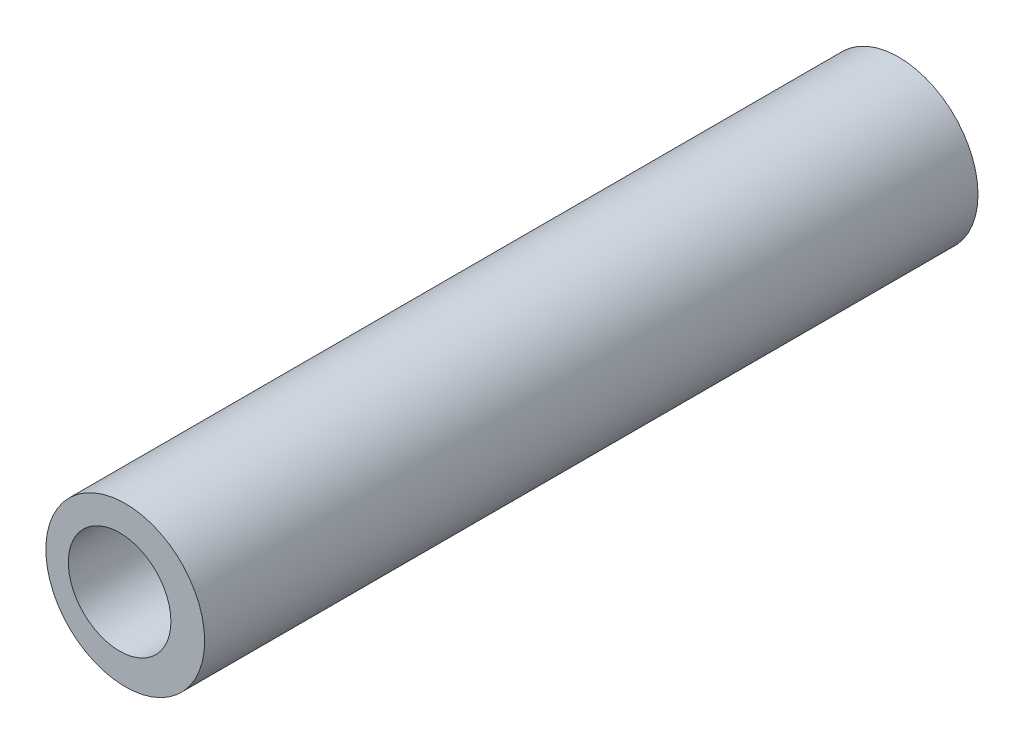
ISO-10303-21;
HEADER;
FILE_DESCRIPTION(('STEP AP214'),'2;1');
FILE_NAME('part.step','',(''),(''),'','','');
FILE_SCHEMA(('AUTOMOTIVE_DESIGN { 1 0 10303 214 1 1 1 1 }'));
ENDSEC;
DATA;
#1=APPLICATION_CONTEXT('core data for automotive mechanical design processes');
#2=APPLICATION_PROTOCOL_DEFINITION('international standard','automotive_design',2000,#1);
#3=PRODUCT_CONTEXT('',#1,'mechanical');
#4=PRODUCT('Part','Part','',(#3));
#5=PRODUCT_RELATED_PRODUCT_CATEGORY('part','',(#4));
#6=PRODUCT_DEFINITION_FORMATION('','',#4);
#7=PRODUCT_DEFINITION_CONTEXT('part definition',#1,'design');
#8=PRODUCT_DEFINITION('design','',#6,#7);
#9=PRODUCT_DEFINITION_SHAPE('','',#8);
#10=(LENGTH_UNIT() NAMED_UNIT(*) SI_UNIT(.MILLI.,.METRE.));
#11=(NAMED_UNIT(*) PLANE_ANGLE_UNIT() SI_UNIT($,.RADIAN.));
#12=(NAMED_UNIT(*) SI_UNIT($,.STERADIAN.) SOLID_ANGLE_UNIT());
#13=UNCERTAINTY_MEASURE_WITH_UNIT(LENGTH_MEASURE(1.E-05),#10,'distance_accuracy_value','');
#14=(GEOMETRIC_REPRESENTATION_CONTEXT(3) GLOBAL_UNCERTAINTY_ASSIGNED_CONTEXT((#13)) GLOBAL_UNIT_ASSIGNED_CONTEXT((#10,
#11,#12)) REPRESENTATION_CONTEXT('',''));
#15=CARTESIAN_POINT('',(0.,0.,0.));
#16=DIRECTION('',(0.,0.,1.));
#17=DIRECTION('',(1.,0.,0.));
#18=AXIS2_PLACEMENT_3D('',#15,#16,#17);
#19=CARTESIAN_POINT('',(0.,0.,825.));
#20=DIRECTION('',(0.,0.,1.));
#21=DIRECTION('',(1.,0.,0.));
#22=AXIS2_PLACEMENT_3D('',#19,#20,#21);
#23=PLANE('',#22);
#24=CARTESIAN_POINT('',(0.,0.,825.));
#25=DIRECTION('',(0.,0.,1.));
#26=DIRECTION('',(1.,0.,0.));
#27=AXIS2_PLACEMENT_3D('',#24,#25,#26);
#28=CIRCLE('',#27,84.7117429401968);
#29=CARTESIAN_POINT('',(84.7117429401968,0.,825.));
#30=VERTEX_POINT('',#29);
#31=EDGE_CURVE('E10',#30,#30,#28,.T.);
#32=ORIENTED_EDGE('',*,*,#31,.T.);
#33=EDGE_LOOP('',(#32));
#34=FACE_BOUND('',#33,.T.);
#35=CARTESIAN_POINT('',(-6.01227688889594,0.,825.));
#36=DIRECTION('',(0.,0.,1.));
#37=DIRECTION('',(1.,0.,0.));
#38=AXIS2_PLACEMENT_3D('',#35,#36,#37);
#39=CIRCLE('',#38,54.7209531290556);
#40=CARTESIAN_POINT('',(48.7086762401597,0.,825.));
#41=VERTEX_POINT('',#40);
#42=EDGE_CURVE('E42',#41,#41,#39,.T.);
#43=ORIENTED_EDGE('',*,*,#42,.F.);
#44=EDGE_LOOP('',(#43));
#45=FACE_BOUND('',#44,.T.);
#46=ADVANCED_FACE('F31',(#34,#45),#23,.T.);
#47=CARTESIAN_POINT('',(0.,0.,0.));
#48=DIRECTION('',(0.,0.,1.));
#49=DIRECTION('',(1.,0.,0.));
#50=AXIS2_PLACEMENT_3D('',#47,#48,#49);
#51=PLANE('',#50);
#52=CARTESIAN_POINT('',(0.,0.,0.));
#53=DIRECTION('',(0.,0.,1.));
#54=DIRECTION('',(1.,0.,0.));
#55=AXIS2_PLACEMENT_3D('',#52,#53,#54);
#56=CIRCLE('',#55,84.7117429401968);
#57=CARTESIAN_POINT('',(84.7117429401968,0.,0.));
#58=VERTEX_POINT('',#57);
#59=EDGE_CURVE('E35',#58,#58,#56,.T.);
#60=ORIENTED_EDGE('',*,*,#59,.F.);
#61=EDGE_LOOP('',(#60));
#62=FACE_BOUND('',#61,.T.);
#63=CARTESIAN_POINT('',(-6.01227688889594,0.,0.));
#64=DIRECTION('',(0.,0.,1.));
#65=DIRECTION('',(1.,0.,0.));
#66=AXIS2_PLACEMENT_3D('',#63,#64,#65);
#67=CIRCLE('',#66,54.7209531290556);
#68=CARTESIAN_POINT('',(48.7086762401597,0.,0.));
#69=VERTEX_POINT('',#68);
#70=EDGE_CURVE('E44',#69,#69,#67,.T.);
#71=ORIENTED_EDGE('',*,*,#70,.T.);
#72=EDGE_LOOP('',(#71));
#73=FACE_BOUND('',#72,.T.);
#74=ADVANCED_FACE('F54',(#62,#73),#51,.F.);
#75=CARTESIAN_POINT('',(0.,0.,825.));
#76=DIRECTION('',(0.,0.,-1.));
#77=DIRECTION('',(-1.,0.,0.));
#78=AXIS2_PLACEMENT_3D('',#75,#76,#77);
#79=CYLINDRICAL_SURFACE('',#78,84.7117429401968);
#80=ORIENTED_EDGE('',*,*,#31,.F.);
#81=EDGE_LOOP('',(#80));
#82=FACE_BOUND('',#81,.T.);
#83=ORIENTED_EDGE('',*,*,#59,.T.);
#84=EDGE_LOOP('',(#83));
#85=FACE_BOUND('',#84,.T.);
#86=ADVANCED_FACE('F33',(#82,#85),#79,.T.);
#87=CARTESIAN_POINT('',(-6.01227688889594,0.,825.));
#88=DIRECTION('',(0.,0.,-1.));
#89=DIRECTION('',(-1.,0.,0.));
#90=AXIS2_PLACEMENT_3D('',#87,#88,#89);
#91=CYLINDRICAL_SURFACE('',#90,54.7209531290556);
#92=ORIENTED_EDGE('',*,*,#42,.T.);
#93=EDGE_LOOP('',(#92));
#94=FACE_BOUND('',#93,.T.);
#95=ORIENTED_EDGE('',*,*,#70,.F.);
#96=EDGE_LOOP('',(#95));
#97=FACE_BOUND('',#96,.T.);
#98=ADVANCED_FACE('F50',(#94,#97),#91,.F.);
#99=CLOSED_SHELL('',(#46,#74,#86,#98));
#100=MANIFOLD_SOLID_BREP('B2',#99);
#101=ADVANCED_BREP_SHAPE_REPRESENTATION('',(#18,#100),#14);
#102=SHAPE_DEFINITION_REPRESENTATION(#9,#101);
ENDSEC;
END-ISO-10303-21;
